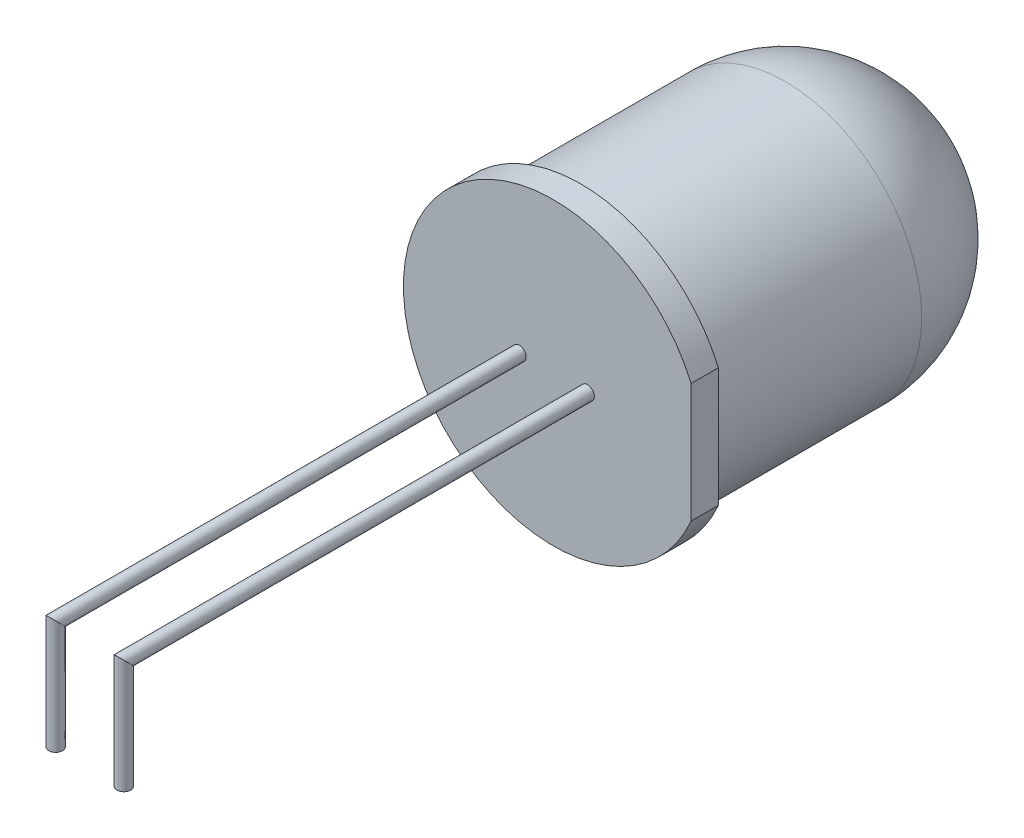
ISO-10303-21;
HEADER;
FILE_DESCRIPTION(('STEP AP214'),'2;1');
FILE_NAME('part.step','',(''),(''),'','','');
FILE_SCHEMA(('AUTOMOTIVE_DESIGN { 1 0 10303 214 1 1 1 1 }'));
ENDSEC;
DATA;
#1=APPLICATION_CONTEXT('core data for automotive mechanical design processes');
#2=APPLICATION_PROTOCOL_DEFINITION('international standard','automotive_design',2000,#1);
#3=PRODUCT_CONTEXT('',#1,'mechanical');
#4=PRODUCT('Part','Part','',(#3));
#5=PRODUCT_RELATED_PRODUCT_CATEGORY('part','',(#4));
#6=PRODUCT_DEFINITION_FORMATION('','',#4);
#7=PRODUCT_DEFINITION_CONTEXT('part definition',#1,'design');
#8=PRODUCT_DEFINITION('design','',#6,#7);
#9=PRODUCT_DEFINITION_SHAPE('','',#8);
#10=(LENGTH_UNIT() NAMED_UNIT(*) SI_UNIT(.MILLI.,.METRE.));
#11=(NAMED_UNIT(*) PLANE_ANGLE_UNIT() SI_UNIT($,.RADIAN.));
#12=(NAMED_UNIT(*) SI_UNIT($,.STERADIAN.) SOLID_ANGLE_UNIT());
#13=UNCERTAINTY_MEASURE_WITH_UNIT(LENGTH_MEASURE(1.E-05),#10,'distance_accuracy_value','');
#14=(GEOMETRIC_REPRESENTATION_CONTEXT(3) GLOBAL_UNCERTAINTY_ASSIGNED_CONTEXT((#13)) GLOBAL_UNIT_ASSIGNED_CONTEXT((#10,
#11,#12)) REPRESENTATION_CONTEXT('',''));
#15=CARTESIAN_POINT('',(0.,0.,0.));
#16=DIRECTION('',(0.,0.,1.));
#17=DIRECTION('',(1.,0.,0.));
#18=AXIS2_PLACEMENT_3D('',#15,#16,#17);
#19=CARTESIAN_POINT('',(0.,0.,13.5));
#20=DIRECTION('',(0.,0.,-1.));
#21=DIRECTION('',(-1.,0.,0.));
#22=AXIS2_PLACEMENT_3D('',#19,#20,#21);
#23=CYLINDRICAL_SURFACE('',#22,5.);
#24=CARTESIAN_POINT('',(0.,0.,5.));
#25=DIRECTION('',(0.,0.,-1.));
#26=DIRECTION('',(-1.,0.,0.));
#27=AXIS2_PLACEMENT_3D('',#24,#25,#26);
#28=CIRCLE('',#27,5.);
#29=CARTESIAN_POINT('',(-5.,0.,5.));
#30=VERTEX_POINT('',#29);
#31=EDGE_CURVE('E76',#30,#30,#28,.F.);
#32=ORIENTED_EDGE('',*,*,#31,.T.);
#33=EDGE_LOOP('',(#32));
#34=FACE_BOUND('',#33,.T.);
#35=CARTESIAN_POINT('',(0.,0.,12.5));
#36=DIRECTION('',(0.,0.,1.));
#37=DIRECTION('',(1.,0.,0.));
#38=AXIS2_PLACEMENT_3D('',#35,#36,#37);
#39=CIRCLE('',#38,5.);
#40=CARTESIAN_POINT('',(5.,0.,12.5));
#41=VERTEX_POINT('',#40);
#42=EDGE_CURVE('E73',#41,#41,#39,.T.);
#43=ORIENTED_EDGE('',*,*,#42,.F.);
#44=EDGE_LOOP('',(#43));
#45=FACE_BOUND('',#44,.T.);
#46=ADVANCED_FACE('F28',(#34,#45),#23,.T.);
#47=CARTESIAN_POINT('',(0.,0.,12.5));
#48=DIRECTION('',(0.,0.,1.));
#49=DIRECTION('',(1.,0.,0.));
#50=AXIS2_PLACEMENT_3D('',#47,#48,#49);
#51=PLANE('',#50);
#52=CARTESIAN_POINT('',(0.,0.,12.5));
#53=DIRECTION('',(0.,0.,1.));
#54=DIRECTION('',(1.,0.,0.));
#55=AXIS2_PLACEMENT_3D('',#52,#53,#54);
#56=CIRCLE('',#55,5.5);
#57=CARTESIAN_POINT('',(5.04764087519863,2.1843355042264,12.5));
#58=VERTEX_POINT('',#57);
#59=CARTESIAN_POINT('',(5.04764087519863,-2.1843355042264,12.5));
#60=VERTEX_POINT('',#59);
#61=EDGE_CURVE('E58',#58,#60,#56,.T.);
#62=ORIENTED_EDGE('',*,*,#61,.F.);
#63=DIRECTION('',(0.,1.,0.));
#64=VECTOR('',#63,1.);
#65=CARTESIAN_POINT('',(5.04764087519863,2.1843355042264,12.5));
#66=LINE('',#65,#64);
#67=EDGE_CURVE('E60',#60,#58,#66,.T.);
#68=ORIENTED_EDGE('',*,*,#67,.F.);
#69=EDGE_LOOP('',(#62,#68));
#70=FACE_BOUND('',#69,.T.);
#71=ORIENTED_EDGE('',*,*,#42,.T.);
#72=EDGE_LOOP('',(#71));
#73=FACE_BOUND('',#72,.T.);
#74=ADVANCED_FACE('F110',(#70,#73),#51,.F.);
#75=CARTESIAN_POINT('',(0.,0.,12.5));
#76=DIRECTION('',(0.,0.,1.));
#77=DIRECTION('',(1.,0.,0.));
#78=AXIS2_PLACEMENT_3D('',#75,#76,#77);
#79=CYLINDRICAL_SURFACE('',#78,5.5);
#80=CARTESIAN_POINT('',(0.,0.,13.5));
#81=DIRECTION('',(0.,0.,1.));
#82=DIRECTION('',(1.,0.,0.));
#83=AXIS2_PLACEMENT_3D('',#80,#81,#82);
#84=CIRCLE('',#83,5.5);
#85=CARTESIAN_POINT('',(5.04764087519863,2.1843355042264,13.5));
#86=VERTEX_POINT('',#85);
#87=CARTESIAN_POINT('',(5.04764087519863,-2.1843355042264,13.5));
#88=VERTEX_POINT('',#87);
#89=EDGE_CURVE('E56',#86,#88,#84,.T.);
#90=ORIENTED_EDGE('',*,*,#89,.F.);
#91=DIRECTION('',(0.,0.,1.));
#92=VECTOR('',#91,1.);
#93=CARTESIAN_POINT('',(5.04764087519863,2.1843355042264,12.5));
#94=LINE('',#93,#92);
#95=EDGE_CURVE('E42',#58,#86,#94,.T.);
#96=ORIENTED_EDGE('',*,*,#95,.F.);
#97=ORIENTED_EDGE('',*,*,#61,.T.);
#98=DIRECTION('',(0.,0.,1.));
#99=VECTOR('',#98,1.);
#100=CARTESIAN_POINT('',(5.04764087519863,-2.1843355042264,12.5));
#101=LINE('',#100,#99);
#102=EDGE_CURVE('E50',#60,#88,#101,.T.);
#103=ORIENTED_EDGE('',*,*,#102,.T.);
#104=EDGE_LOOP('',(#90,#96,#97,#103));
#105=FACE_BOUND('',#104,.T.);
#106=ADVANCED_FACE('F55',(#105),#79,.T.);
#107=CARTESIAN_POINT('',(5.04764087519863,2.1843355042264,12.5));
#108=DIRECTION('',(1.,0.,0.));
#109=DIRECTION('',(0.,0.,-1.));
#110=AXIS2_PLACEMENT_3D('',#107,#108,#109);
#111=PLANE('',#110);
#112=DIRECTION('',(0.,1.,0.));
#113=VECTOR('',#112,1.);
#114=CARTESIAN_POINT('',(5.04764087519863,2.1843355042264,13.5));
#115=LINE('',#114,#113);
#116=EDGE_CURVE('E64',#88,#86,#115,.T.);
#117=ORIENTED_EDGE('',*,*,#116,.F.);
#118=ORIENTED_EDGE('',*,*,#102,.F.);
#119=ORIENTED_EDGE('',*,*,#67,.T.);
#120=ORIENTED_EDGE('',*,*,#95,.T.);
#121=EDGE_LOOP('',(#117,#118,#119,#120));
#122=FACE_BOUND('',#121,.T.);
#123=ADVANCED_FACE('F67',(#122),#111,.T.);
#124=CARTESIAN_POINT('',(0.,0.,13.5));
#125=DIRECTION('',(0.,0.,1.));
#126=DIRECTION('',(1.,0.,0.));
#127=AXIS2_PLACEMENT_3D('',#124,#125,#126);
#128=PLANE('',#127);
#129=CARTESIAN_POINT('',(1.25,0.,13.5));
#130=DIRECTION('',(0.,0.,1.));
#131=DIRECTION('',(1.,0.,0.));
#132=AXIS2_PLACEMENT_3D('',#129,#130,#131);
#133=CIRCLE('',#132,0.25);
#134=CARTESIAN_POINT('',(1.5,0.,13.5));
#135=VERTEX_POINT('',#134);
#136=EDGE_CURVE('E12',#135,#135,#133,.T.);
#137=ORIENTED_EDGE('',*,*,#136,.F.);
#138=EDGE_LOOP('',(#137));
#139=FACE_BOUND('',#138,.T.);
#140=CARTESIAN_POINT('',(-1.25,0.,13.5));
#141=DIRECTION('',(0.,0.,1.));
#142=DIRECTION('',(1.,0.,0.));
#143=AXIS2_PLACEMENT_3D('',#140,#141,#142);
#144=CIRCLE('',#143,0.25);
#145=CARTESIAN_POINT('',(-1.,0.,13.5));
#146=VERTEX_POINT('',#145);
#147=EDGE_CURVE('E35',#146,#146,#144,.T.);
#148=ORIENTED_EDGE('',*,*,#147,.F.);
#149=EDGE_LOOP('',(#148));
#150=FACE_BOUND('',#149,.T.);
#151=ORIENTED_EDGE('',*,*,#89,.T.);
#152=ORIENTED_EDGE('',*,*,#116,.T.);
#153=EDGE_LOOP('',(#151,#152));
#154=FACE_BOUND('',#153,.T.);
#155=ADVANCED_FACE('F63',(#139,#150,#154),#128,.T.);
#156=CARTESIAN_POINT('',(0.,0.,5.));
#157=DIRECTION('',(0.,0.,1.));
#158=DIRECTION('',(1.,0.,0.));
#159=AXIS2_PLACEMENT_3D('',#156,#157,#158);
#160=SPHERICAL_SURFACE('',#159,5.);
#161=ORIENTED_EDGE('',*,*,#31,.F.);
#162=EDGE_LOOP('',(#161));
#163=FACE_BOUND('',#162,.T.);
#164=ADVANCED_FACE('F127',(#163),#160,.T.);
#165=CARTESIAN_POINT('',(-1.25,0.,30.5));
#166=DIRECTION('',(0.,-1.,0.));
#167=DIRECTION('',(0.,0.,-1.));
#168=AXIS2_PLACEMENT_3D('',#165,#166,#167);
#169=CYLINDRICAL_SURFACE('',#168,0.25);
#170=CARTESIAN_POINT('',(-1.25,0.,30.5));
#171=DIRECTION('',(0.,-0.707106781186548,0.707106781186548));
#172=DIRECTION('',(0.,-0.707106781186548,-0.707106781186548));
#173=AXIS2_PLACEMENT_3D('',#170,#171,#172);
#174=ELLIPSE('',#173,0.353553390593274,0.25);
#175=CARTESIAN_POINT('',(-1.25,-0.25,30.25));
#176=VERTEX_POINT('',#175);
#177=EDGE_CURVE('E88',#176,#176,#174,.T.);
#178=ORIENTED_EDGE('',*,*,#177,.T.);
#179=EDGE_LOOP('',(#178));
#180=FACE_BOUND('',#179,.T.);
#181=CARTESIAN_POINT('',(-1.25,-4.,30.5));
#182=DIRECTION('',(0.,-1.,0.));
#183=DIRECTION('',(0.,0.,-1.));
#184=AXIS2_PLACEMENT_3D('',#181,#182,#183);
#185=CIRCLE('',#184,0.25);
#186=CARTESIAN_POINT('',(-1.25,-4.,30.25));
#187=VERTEX_POINT('',#186);
#188=EDGE_CURVE('E65',#187,#187,#185,.F.);
#189=ORIENTED_EDGE('',*,*,#188,.T.);
#190=EDGE_LOOP('',(#189));
#191=FACE_BOUND('',#190,.T.);
#192=ADVANCED_FACE('F93',(#180,#191),#169,.T.);
#193=CARTESIAN_POINT('',(-1.25,0.,31.2071067811865));
#194=DIRECTION('',(0.,0.,-1.));
#195=DIRECTION('',(-1.,0.,0.));
#196=AXIS2_PLACEMENT_3D('',#193,#194,#195);
#197=CYLINDRICAL_SURFACE('',#196,0.25);
#198=ORIENTED_EDGE('',*,*,#147,.T.);
#199=EDGE_LOOP('',(#198));
#200=FACE_BOUND('',#199,.T.);
#201=ORIENTED_EDGE('',*,*,#177,.F.);
#202=EDGE_LOOP('',(#201));
#203=FACE_BOUND('',#202,.T.);
#204=ADVANCED_FACE('F98',(#200,#203),#197,.T.);
#205=CARTESIAN_POINT('',(-1.25,-4.,30.5));
#206=DIRECTION('',(0.,-1.,0.));
#207=DIRECTION('',(0.,0.,-1.));
#208=AXIS2_PLACEMENT_3D('',#205,#206,#207);
#209=PLANE('',#208);
#210=ORIENTED_EDGE('',*,*,#188,.F.);
#211=EDGE_LOOP('',(#210));
#212=FACE_BOUND('',#211,.T.);
#213=ADVANCED_FACE('F95',(#212),#209,.T.);
#214=CARTESIAN_POINT('',(1.25,0.,30.5));
#215=DIRECTION('',(0.,-1.,0.));
#216=DIRECTION('',(0.,0.,-1.));
#217=AXIS2_PLACEMENT_3D('',#214,#215,#216);
#218=CYLINDRICAL_SURFACE('',#217,0.25);
#219=CARTESIAN_POINT('',(1.25,0.,30.5));
#220=DIRECTION('',(0.,-0.707106781186548,0.707106781186548));
#221=DIRECTION('',(0.,-0.707106781186548,-0.707106781186548));
#222=AXIS2_PLACEMENT_3D('',#219,#220,#221);
#223=ELLIPSE('',#222,0.353553390593274,0.25);
#224=CARTESIAN_POINT('',(1.25,-0.25,30.25));
#225=VERTEX_POINT('',#224);
#226=EDGE_CURVE('E142',#225,#225,#223,.F.);
#227=ORIENTED_EDGE('',*,*,#226,.F.);
#228=EDGE_LOOP('',(#227));
#229=FACE_BOUND('',#228,.T.);
#230=CARTESIAN_POINT('',(1.25,-4.,30.5));
#231=DIRECTION('',(0.,-1.,0.));
#232=DIRECTION('',(0.,0.,-1.));
#233=AXIS2_PLACEMENT_3D('',#230,#231,#232);
#234=CIRCLE('',#233,0.25);
#235=CARTESIAN_POINT('',(1.25,-4.,30.25));
#236=VERTEX_POINT('',#235);
#237=EDGE_CURVE('E86',#236,#236,#234,.T.);
#238=ORIENTED_EDGE('',*,*,#237,.F.);
#239=EDGE_LOOP('',(#238));
#240=FACE_BOUND('',#239,.T.);
#241=ADVANCED_FACE('F97',(#229,#240),#218,.T.);
#242=CARTESIAN_POINT('',(1.25,0.,31.2071067811865));
#243=DIRECTION('',(0.,0.,-1.));
#244=DIRECTION('',(-1.,0.,0.));
#245=AXIS2_PLACEMENT_3D('',#242,#243,#244);
#246=CYLINDRICAL_SURFACE('',#245,0.25);
#247=ORIENTED_EDGE('',*,*,#136,.T.);
#248=EDGE_LOOP('',(#247));
#249=FACE_BOUND('',#248,.T.);
#250=ORIENTED_EDGE('',*,*,#226,.T.);
#251=EDGE_LOOP('',(#250));
#252=FACE_BOUND('',#251,.T.);
#253=ADVANCED_FACE('F105',(#249,#252),#246,.T.);
#254=CARTESIAN_POINT('',(1.25,-4.,30.5));
#255=DIRECTION('',(0.,-1.,0.));
#256=DIRECTION('',(0.,0.,-1.));
#257=AXIS2_PLACEMENT_3D('',#254,#255,#256);
#258=PLANE('',#257);
#259=ORIENTED_EDGE('',*,*,#237,.T.);
#260=EDGE_LOOP('',(#259));
#261=FACE_BOUND('',#260,.T.);
#262=ADVANCED_FACE('F138',(#261),#258,.T.);
#263=CLOSED_SHELL('',(#46,#74,#106,#123,#155,#164,#192,#204,#213,#241,#253,#262));
#264=MANIFOLD_SOLID_BREP('B2',#263);
#265=ADVANCED_BREP_SHAPE_REPRESENTATION('',(#18,#264),#14);
#266=SHAPE_DEFINITION_REPRESENTATION(#9,#265);
ENDSEC;
END-ISO-10303-21;
